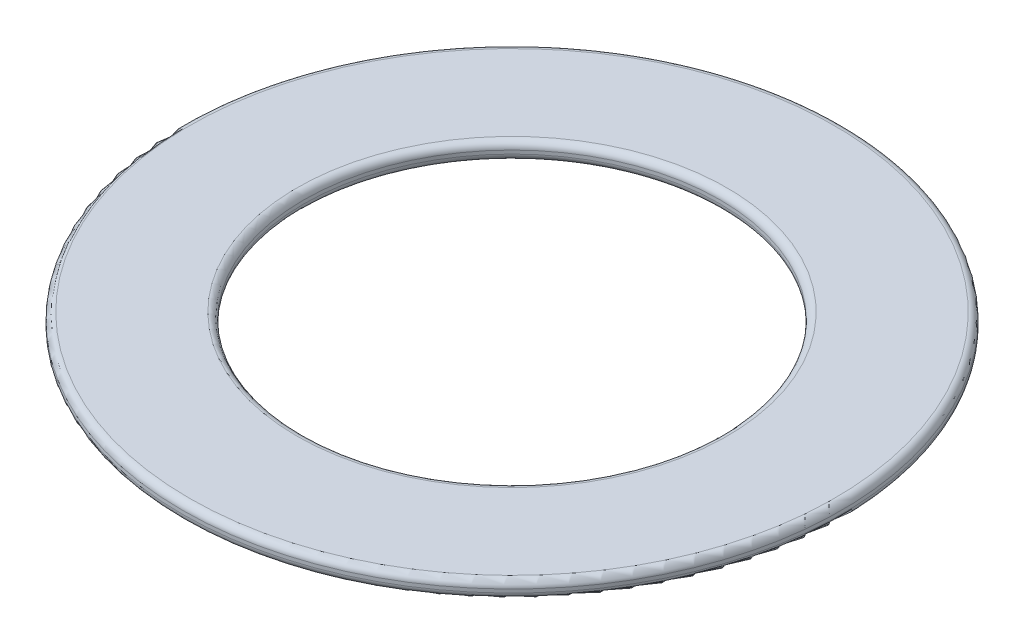
ISO-10303-21;
HEADER;
FILE_DESCRIPTION(('STEP AP214'),'2;1');
FILE_NAME('part.step','',(''),(''),'','','');
FILE_SCHEMA(('AUTOMOTIVE_DESIGN { 1 0 10303 214 1 1 1 1 }'));
ENDSEC;
DATA;
#1=APPLICATION_CONTEXT('core data for automotive mechanical design processes');
#2=APPLICATION_PROTOCOL_DEFINITION('international standard','automotive_design',2000,#1);
#3=PRODUCT_CONTEXT('',#1,'mechanical');
#4=PRODUCT('Part','Part','',(#3));
#5=PRODUCT_RELATED_PRODUCT_CATEGORY('part','',(#4));
#6=PRODUCT_DEFINITION_FORMATION('','',#4);
#7=PRODUCT_DEFINITION_CONTEXT('part definition',#1,'design');
#8=PRODUCT_DEFINITION('design','',#6,#7);
#9=PRODUCT_DEFINITION_SHAPE('','',#8);
#10=(LENGTH_UNIT() NAMED_UNIT(*) SI_UNIT(.MILLI.,.METRE.));
#11=(NAMED_UNIT(*) PLANE_ANGLE_UNIT() SI_UNIT($,.RADIAN.));
#12=(NAMED_UNIT(*) SI_UNIT($,.STERADIAN.) SOLID_ANGLE_UNIT());
#13=UNCERTAINTY_MEASURE_WITH_UNIT(LENGTH_MEASURE(1.E-05),#10,'distance_accuracy_value','');
#14=(GEOMETRIC_REPRESENTATION_CONTEXT(3) GLOBAL_UNCERTAINTY_ASSIGNED_CONTEXT((#13)) GLOBAL_UNIT_ASSIGNED_CONTEXT((#10,
#11,#12)) REPRESENTATION_CONTEXT('',''));
#15=CARTESIAN_POINT('',(0.,0.,0.));
#16=DIRECTION('',(0.,0.,1.));
#17=DIRECTION('',(1.,0.,0.));
#18=AXIS2_PLACEMENT_3D('',#15,#16,#17);
#19=CARTESIAN_POINT('',(0.,0.5,0.));
#20=DIRECTION('',(0.,1.,0.));
#21=DIRECTION('',(0.,0.,1.));
#22=AXIS2_PLACEMENT_3D('',#19,#20,#21);
#23=PLANE('',#22);
#24=CARTESIAN_POINT('',(0.,0.5,0.));
#25=DIRECTION('',(0.,1.,0.));
#26=DIRECTION('',(0.,0.,1.));
#27=AXIS2_PLACEMENT_3D('',#24,#25,#26);
#28=CIRCLE('',#27,6.2);
#29=CARTESIAN_POINT('',(0.,0.5,6.2));
#30=VERTEX_POINT('',#29);
#31=EDGE_CURVE('E55',#30,#30,#28,.F.);
#32=ORIENTED_EDGE('',*,*,#31,.T.);
#33=EDGE_LOOP('',(#32));
#34=FACE_BOUND('',#33,.T.);
#35=CARTESIAN_POINT('',(0.,0.5,0.));
#36=DIRECTION('',(0.,1.,0.));
#37=DIRECTION('',(0.,0.,1.));
#38=AXIS2_PLACEMENT_3D('',#35,#36,#37);
#39=CIRCLE('',#38,9.3);
#40=CARTESIAN_POINT('',(0.,0.5,9.3));
#41=VERTEX_POINT('',#40);
#42=EDGE_CURVE('E60',#41,#41,#39,.T.);
#43=ORIENTED_EDGE('',*,*,#42,.T.);
#44=EDGE_LOOP('',(#43));
#45=FACE_BOUND('',#44,.T.);
#46=ADVANCED_FACE('F42',(#34,#45),#23,.T.);
#47=CARTESIAN_POINT('',(0.,0.,0.));
#48=DIRECTION('',(0.,1.,0.));
#49=DIRECTION('',(0.,0.,1.));
#50=AXIS2_PLACEMENT_3D('',#47,#48,#49);
#51=PLANE('',#50);
#52=CARTESIAN_POINT('',(0.,0.,0.));
#53=DIRECTION('',(0.,1.,0.));
#54=DIRECTION('',(0.,0.,1.));
#55=AXIS2_PLACEMENT_3D('',#52,#53,#54);
#56=CIRCLE('',#55,6.2);
#57=CARTESIAN_POINT('',(0.,0.,6.2));
#58=VERTEX_POINT('',#57);
#59=EDGE_CURVE('E74',#58,#58,#56,.T.);
#60=ORIENTED_EDGE('',*,*,#59,.T.);
#61=EDGE_LOOP('',(#60));
#62=FACE_BOUND('',#61,.T.);
#63=CARTESIAN_POINT('',(0.,0.,0.));
#64=DIRECTION('',(0.,1.,0.));
#65=DIRECTION('',(0.,0.,1.));
#66=AXIS2_PLACEMENT_3D('',#63,#64,#65);
#67=CIRCLE('',#66,9.3);
#68=CARTESIAN_POINT('',(0.,0.,9.3));
#69=VERTEX_POINT('',#68);
#70=EDGE_CURVE('E78',#69,#69,#67,.F.);
#71=ORIENTED_EDGE('',*,*,#70,.T.);
#72=EDGE_LOOP('',(#71));
#73=FACE_BOUND('',#72,.T.);
#74=ADVANCED_FACE('F83',(#62,#73),#51,.F.);
#75=CARTESIAN_POINT('',(0.,0.5,0.));
#76=DIRECTION('',(0.,-1.,0.));
#77=DIRECTION('',(0.,0.,-1.));
#78=AXIS2_PLACEMENT_3D('',#75,#76,#77);
#79=CYLINDRICAL_SURFACE('',#78,9.5);
#80=CARTESIAN_POINT('',(0.,0.2,0.));
#81=DIRECTION('',(0.,1.,0.));
#82=DIRECTION('',(0.,0.,1.));
#83=AXIS2_PLACEMENT_3D('',#80,#81,#82);
#84=CIRCLE('',#83,9.5);
#85=CARTESIAN_POINT('',(0.,0.2,9.5));
#86=VERTEX_POINT('',#85);
#87=EDGE_CURVE('E10',#86,#86,#84,.T.);
#88=ORIENTED_EDGE('',*,*,#87,.T.);
#89=EDGE_LOOP('',(#88));
#90=FACE_BOUND('',#89,.T.);
#91=CARTESIAN_POINT('',(0.,0.3,0.));
#92=DIRECTION('',(0.,1.,0.));
#93=DIRECTION('',(0.,0.,1.));
#94=AXIS2_PLACEMENT_3D('',#91,#92,#93);
#95=CIRCLE('',#94,9.5);
#96=CARTESIAN_POINT('',(0.,0.3,9.5));
#97=VERTEX_POINT('',#96);
#98=EDGE_CURVE('E50',#97,#97,#95,.F.);
#99=ORIENTED_EDGE('',*,*,#98,.T.);
#100=EDGE_LOOP('',(#99));
#101=FACE_BOUND('',#100,.T.);
#102=ADVANCED_FACE('F103',(#90,#101),#79,.T.);
#103=CARTESIAN_POINT('',(0.,0.5,0.));
#104=DIRECTION('',(0.,-1.,0.));
#105=DIRECTION('',(0.,0.,-1.));
#106=AXIS2_PLACEMENT_3D('',#103,#104,#105);
#107=CYLINDRICAL_SURFACE('',#106,6.);
#108=CARTESIAN_POINT('',(0.,0.2,0.));
#109=DIRECTION('',(0.,1.,0.));
#110=DIRECTION('',(0.,0.,1.));
#111=AXIS2_PLACEMENT_3D('',#108,#109,#110);
#112=CIRCLE('',#111,6.);
#113=CARTESIAN_POINT('',(0.,0.2,6.));
#114=VERTEX_POINT('',#113);
#115=EDGE_CURVE('E66',#114,#114,#112,.F.);
#116=ORIENTED_EDGE('',*,*,#115,.T.);
#117=EDGE_LOOP('',(#116));
#118=FACE_BOUND('',#117,.T.);
#119=CARTESIAN_POINT('',(0.,0.3,0.));
#120=DIRECTION('',(0.,1.,0.));
#121=DIRECTION('',(0.,0.,1.));
#122=AXIS2_PLACEMENT_3D('',#119,#120,#121);
#123=CIRCLE('',#122,6.);
#124=CARTESIAN_POINT('',(0.,0.3,6.));
#125=VERTEX_POINT('',#124);
#126=EDGE_CURVE('E70',#125,#125,#123,.T.);
#127=ORIENTED_EDGE('',*,*,#126,.T.);
#128=EDGE_LOOP('',(#127));
#129=FACE_BOUND('',#128,.T.);
#130=ADVANCED_FACE('F108',(#118,#129),#107,.F.);
#131=CARTESIAN_POINT('',(0.,0.2,0.));
#132=DIRECTION('',(0.,1.,0.));
#133=DIRECTION('',(0.,0.,1.));
#134=AXIS2_PLACEMENT_3D('',#131,#132,#133);
#135=TOROIDAL_SURFACE('',#134,6.2,0.2);
#136=ORIENTED_EDGE('',*,*,#115,.F.);
#137=EDGE_LOOP('',(#136));
#138=FACE_BOUND('',#137,.T.);
#139=ORIENTED_EDGE('',*,*,#59,.F.);
#140=EDGE_LOOP('',(#139));
#141=FACE_BOUND('',#140,.T.);
#142=ADVANCED_FACE('F94',(#138,#141),#135,.T.);
#143=CARTESIAN_POINT('',(0.,0.3,0.));
#144=DIRECTION('',(0.,1.,0.));
#145=DIRECTION('',(0.,0.,1.));
#146=AXIS2_PLACEMENT_3D('',#143,#144,#145);
#147=TOROIDAL_SURFACE('',#146,6.2,0.2);
#148=ORIENTED_EDGE('',*,*,#31,.F.);
#149=EDGE_LOOP('',(#148));
#150=FACE_BOUND('',#149,.T.);
#151=ORIENTED_EDGE('',*,*,#126,.F.);
#152=EDGE_LOOP('',(#151));
#153=FACE_BOUND('',#152,.T.);
#154=ADVANCED_FACE('F88',(#150,#153),#147,.T.);
#155=CARTESIAN_POINT('',(0.,0.2,0.));
#156=DIRECTION('',(0.,1.,0.));
#157=DIRECTION('',(0.,0.,1.));
#158=AXIS2_PLACEMENT_3D('',#155,#156,#157);
#159=TOROIDAL_SURFACE('',#158,9.3,0.2);
#160=ORIENTED_EDGE('',*,*,#70,.F.);
#161=EDGE_LOOP('',(#160));
#162=FACE_BOUND('',#161,.T.);
#163=ORIENTED_EDGE('',*,*,#87,.F.);
#164=EDGE_LOOP('',(#163));
#165=FACE_BOUND('',#164,.T.);
#166=ADVANCED_FACE('F85',(#162,#165),#159,.T.);
#167=CARTESIAN_POINT('',(0.,0.3,0.));
#168=DIRECTION('',(0.,1.,0.));
#169=DIRECTION('',(0.,0.,1.));
#170=AXIS2_PLACEMENT_3D('',#167,#168,#169);
#171=TOROIDAL_SURFACE('',#170,9.3,0.2);
#172=ORIENTED_EDGE('',*,*,#98,.F.);
#173=EDGE_LOOP('',(#172));
#174=FACE_BOUND('',#173,.T.);
#175=ORIENTED_EDGE('',*,*,#42,.F.);
#176=EDGE_LOOP('',(#175));
#177=FACE_BOUND('',#176,.T.);
#178=ADVANCED_FACE('F44',(#174,#177),#171,.T.);
#179=CLOSED_SHELL('',(#46,#74,#102,#130,#142,#154,#166,#178));
#180=MANIFOLD_SOLID_BREP('B2',#179);
#181=ADVANCED_BREP_SHAPE_REPRESENTATION('',(#18,#180),#14);
#182=SHAPE_DEFINITION_REPRESENTATION(#9,#181);
ENDSEC;
END-ISO-10303-21;
